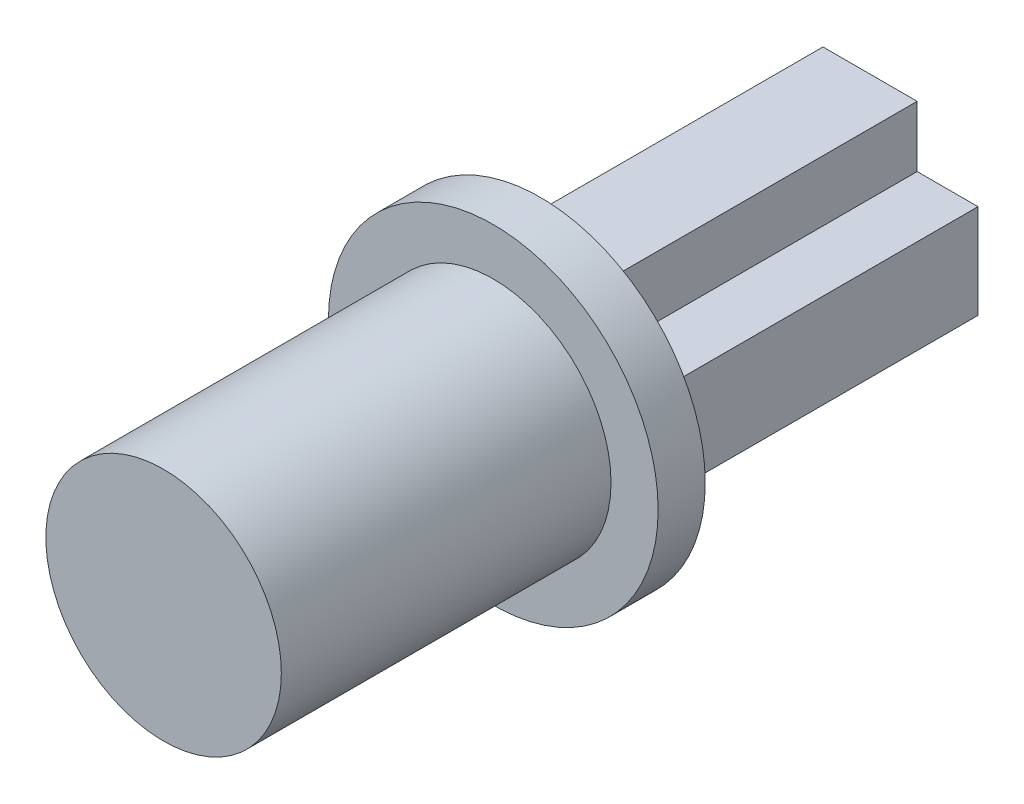
ISO-10303-21;
HEADER;
FILE_DESCRIPTION(('STEP AP214'),'2;1');
FILE_NAME('part.step','',(''),(''),'','','');
FILE_SCHEMA(('AUTOMOTIVE_DESIGN { 1 0 10303 214 1 1 1 1 }'));
ENDSEC;
DATA;
#1=APPLICATION_CONTEXT('core data for automotive mechanical design processes');
#2=APPLICATION_PROTOCOL_DEFINITION('international standard','automotive_design',2000,#1);
#3=PRODUCT_CONTEXT('',#1,'mechanical');
#4=PRODUCT('Part','Part','',(#3));
#5=PRODUCT_RELATED_PRODUCT_CATEGORY('part','',(#4));
#6=PRODUCT_DEFINITION_FORMATION('','',#4);
#7=PRODUCT_DEFINITION_CONTEXT('part definition',#1,'design');
#8=PRODUCT_DEFINITION('design','',#6,#7);
#9=PRODUCT_DEFINITION_SHAPE('','',#8);
#10=(LENGTH_UNIT() NAMED_UNIT(*) SI_UNIT(.MILLI.,.METRE.));
#11=(NAMED_UNIT(*) PLANE_ANGLE_UNIT() SI_UNIT($,.RADIAN.));
#12=(NAMED_UNIT(*) SI_UNIT($,.STERADIAN.) SOLID_ANGLE_UNIT());
#13=UNCERTAINTY_MEASURE_WITH_UNIT(LENGTH_MEASURE(1.E-05),#10,'distance_accuracy_value','');
#14=(GEOMETRIC_REPRESENTATION_CONTEXT(3) GLOBAL_UNCERTAINTY_ASSIGNED_CONTEXT((#13)) GLOBAL_UNIT_ASSIGNED_CONTEXT((#10,
#11,#12)) REPRESENTATION_CONTEXT('',''));
#15=CARTESIAN_POINT('',(0.,0.,0.));
#16=DIRECTION('',(0.,0.,1.));
#17=DIRECTION('',(1.,0.,0.));
#18=AXIS2_PLACEMENT_3D('',#15,#16,#17);
#19=CARTESIAN_POINT('',(2.29128784747792,0.973432182416137,7.));
#20=DIRECTION('',(-1.,0.,0.));
#21=DIRECTION('',(0.,-1.,0.));
#22=AXIS2_PLACEMENT_3D('',#19,#20,#21);
#23=PLANE('',#22);
#24=DIRECTION('',(0.,1.,0.));
#25=VECTOR('',#24,1.);
#26=CARTESIAN_POINT('',(2.29128784747792,0.973432182416137,0.));
#27=LINE('',#26,#25);
#28=CARTESIAN_POINT('',(2.29128784747791,-1.02656781758385,0.));
#29=VERTEX_POINT('',#28);
#30=CARTESIAN_POINT('',(2.29128784747792,0.973432182416137,0.));
#31=VERTEX_POINT('',#30);
#32=EDGE_CURVE('E185',#29,#31,#27,.T.);
#33=ORIENTED_EDGE('',*,*,#32,.T.);
#34=DIRECTION('',(0.,0.,-1.));
#35=VECTOR('',#34,1.);
#36=CARTESIAN_POINT('',(2.29128784747792,0.973432182416137,7.));
#37=LINE('',#36,#35);
#38=CARTESIAN_POINT('',(2.29128784747792,0.973432182416137,7.));
#39=VERTEX_POINT('',#38);
#40=EDGE_CURVE('E48',#39,#31,#37,.T.);
#41=ORIENTED_EDGE('',*,*,#40,.F.);
#42=DIRECTION('',(0.,1.,0.));
#43=VECTOR('',#42,1.);
#44=CARTESIAN_POINT('',(2.29128784747792,0.973432182416137,7.));
#45=LINE('',#44,#43);
#46=CARTESIAN_POINT('',(2.29128784747791,-1.02656781758385,7.));
#47=VERTEX_POINT('',#46);
#48=EDGE_CURVE('E220',#47,#39,#45,.T.);
#49=ORIENTED_EDGE('',*,*,#48,.F.);
#50=DIRECTION('',(0.,0.,-1.));
#51=VECTOR('',#50,1.);
#52=CARTESIAN_POINT('',(2.29128784747791,-1.02656781758385,7.));
#53=LINE('',#52,#51);
#54=EDGE_CURVE('E184',#47,#29,#53,.T.);
#55=ORIENTED_EDGE('',*,*,#54,.T.);
#56=EDGE_LOOP('',(#33,#41,#49,#55));
#57=FACE_BOUND('',#56,.T.);
#58=ADVANCED_FACE('F45',(#57),#23,.F.);
#59=CARTESIAN_POINT('',(0.999999999999991,0.973432182416137,7.));
#60=DIRECTION('',(0.,-1.,0.));
#61=DIRECTION('',(0.,0.,-1.));
#62=AXIS2_PLACEMENT_3D('',#59,#60,#61);
#63=PLANE('',#62);
#64=DIRECTION('',(-1.,0.,0.));
#65=VECTOR('',#64,1.);
#66=CARTESIAN_POINT('',(0.999999999999991,0.973432182416137,0.));
#67=LINE('',#66,#65);
#68=CARTESIAN_POINT('',(0.999999999999991,0.973432182416137,0.));
#69=VERTEX_POINT('',#68);
#70=EDGE_CURVE('E189',#31,#69,#67,.T.);
#71=ORIENTED_EDGE('',*,*,#70,.T.);
#72=DIRECTION('',(0.,0.,-1.));
#73=VECTOR('',#72,1.);
#74=CARTESIAN_POINT('',(0.999999999999991,0.973432182416137,7.));
#75=LINE('',#74,#73);
#76=CARTESIAN_POINT('',(0.999999999999991,0.973432182416137,7.));
#77=VERTEX_POINT('',#76);
#78=EDGE_CURVE('E248',#77,#69,#75,.T.);
#79=ORIENTED_EDGE('',*,*,#78,.F.);
#80=DIRECTION('',(-1.,0.,0.));
#81=VECTOR('',#80,1.);
#82=CARTESIAN_POINT('',(0.999999999999991,0.973432182416137,7.));
#83=LINE('',#82,#81);
#84=EDGE_CURVE('E118',#39,#77,#83,.T.);
#85=ORIENTED_EDGE('',*,*,#84,.F.);
#86=ORIENTED_EDGE('',*,*,#40,.T.);
#87=EDGE_LOOP('',(#71,#79,#85,#86));
#88=FACE_BOUND('',#87,.T.);
#89=ADVANCED_FACE('F255',(#88),#63,.F.);
#90=CARTESIAN_POINT('',(0.999999999999991,2.26472002989408,7.));
#91=DIRECTION('',(-1.,0.,0.));
#92=DIRECTION('',(0.,0.,1.));
#93=AXIS2_PLACEMENT_3D('',#90,#91,#92);
#94=PLANE('',#93);
#95=DIRECTION('',(0.,1.,0.));
#96=VECTOR('',#95,1.);
#97=CARTESIAN_POINT('',(0.999999999999991,2.26472002989408,0.));
#98=LINE('',#97,#96);
#99=CARTESIAN_POINT('',(0.999999999999991,2.26472002989408,0.));
#100=VERTEX_POINT('',#99);
#101=EDGE_CURVE('E193',#69,#100,#98,.T.);
#102=ORIENTED_EDGE('',*,*,#101,.T.);
#103=DIRECTION('',(0.,0.,-1.));
#104=VECTOR('',#103,1.);
#105=CARTESIAN_POINT('',(0.999999999999991,2.26472002989408,7.));
#106=LINE('',#105,#104);
#107=CARTESIAN_POINT('',(0.999999999999991,2.26472002989408,7.));
#108=VERTEX_POINT('',#107);
#109=EDGE_CURVE('E245',#108,#100,#106,.T.);
#110=ORIENTED_EDGE('',*,*,#109,.F.);
#111=DIRECTION('',(0.,1.,0.));
#112=VECTOR('',#111,1.);
#113=CARTESIAN_POINT('',(0.999999999999991,2.26472002989408,7.));
#114=LINE('',#113,#112);
#115=EDGE_CURVE('E275',#77,#108,#114,.T.);
#116=ORIENTED_EDGE('',*,*,#115,.F.);
#117=ORIENTED_EDGE('',*,*,#78,.T.);
#118=EDGE_LOOP('',(#102,#110,#116,#117));
#119=FACE_BOUND('',#118,.T.);
#120=ADVANCED_FACE('F264',(#119),#94,.F.);
#121=CARTESIAN_POINT('',(-0.999999999999997,2.26472002989408,7.));
#122=DIRECTION('',(0.,-1.,0.));
#123=DIRECTION('',(1.,0.,0.));
#124=AXIS2_PLACEMENT_3D('',#121,#122,#123);
#125=PLANE('',#124);
#126=DIRECTION('',(-1.,0.,0.));
#127=VECTOR('',#126,1.);
#128=CARTESIAN_POINT('',(-0.999999999999997,2.26472002989408,0.));
#129=LINE('',#128,#127);
#130=CARTESIAN_POINT('',(-0.999999999999997,2.26472002989408,0.));
#131=VERTEX_POINT('',#130);
#132=EDGE_CURVE('E196',#100,#131,#129,.T.);
#133=ORIENTED_EDGE('',*,*,#132,.T.);
#134=DIRECTION('',(0.,0.,-1.));
#135=VECTOR('',#134,1.);
#136=CARTESIAN_POINT('',(-0.999999999999997,2.26472002989408,7.));
#137=LINE('',#136,#135);
#138=CARTESIAN_POINT('',(-0.999999999999997,2.26472002989408,7.));
#139=VERTEX_POINT('',#138);
#140=EDGE_CURVE('E241',#139,#131,#137,.T.);
#141=ORIENTED_EDGE('',*,*,#140,.F.);
#142=DIRECTION('',(-1.,0.,0.));
#143=VECTOR('',#142,1.);
#144=CARTESIAN_POINT('',(-0.999999999999997,2.26472002989408,7.));
#145=LINE('',#144,#143);
#146=EDGE_CURVE('E269',#108,#139,#145,.T.);
#147=ORIENTED_EDGE('',*,*,#146,.F.);
#148=ORIENTED_EDGE('',*,*,#109,.T.);
#149=EDGE_LOOP('',(#133,#141,#147,#148));
#150=FACE_BOUND('',#149,.T.);
#151=ADVANCED_FACE('F267',(#150),#125,.F.);
#152=CARTESIAN_POINT('',(-0.999999999999997,0.97343218241615,7.));
#153=DIRECTION('',(1.,0.,0.));
#154=DIRECTION('',(0.,0.,-1.));
#155=AXIS2_PLACEMENT_3D('',#152,#153,#154);
#156=PLANE('',#155);
#157=DIRECTION('',(0.,-1.,0.));
#158=VECTOR('',#157,1.);
#159=CARTESIAN_POINT('',(-0.999999999999997,0.97343218241615,0.));
#160=LINE('',#159,#158);
#161=CARTESIAN_POINT('',(-0.999999999999997,0.97343218241615,0.));
#162=VERTEX_POINT('',#161);
#163=EDGE_CURVE('E199',#131,#162,#160,.T.);
#164=ORIENTED_EDGE('',*,*,#163,.T.);
#165=DIRECTION('',(0.,0.,-1.));
#166=VECTOR('',#165,1.);
#167=CARTESIAN_POINT('',(-0.999999999999997,0.97343218241615,7.));
#168=LINE('',#167,#166);
#169=CARTESIAN_POINT('',(-0.999999999999997,0.97343218241615,7.));
#170=VERTEX_POINT('',#169);
#171=EDGE_CURVE('E237',#170,#162,#168,.T.);
#172=ORIENTED_EDGE('',*,*,#171,.F.);
#173=DIRECTION('',(0.,-1.,0.));
#174=VECTOR('',#173,1.);
#175=CARTESIAN_POINT('',(-0.999999999999997,0.97343218241615,7.));
#176=LINE('',#175,#174);
#177=EDGE_CURVE('E274',#139,#170,#176,.T.);
#178=ORIENTED_EDGE('',*,*,#177,.F.);
#179=ORIENTED_EDGE('',*,*,#140,.T.);
#180=EDGE_LOOP('',(#164,#172,#178,#179));
#181=FACE_BOUND('',#180,.T.);
#182=ADVANCED_FACE('F319',(#181),#156,.F.);
#183=CARTESIAN_POINT('',(-2.29128784747793,0.97343218241615,7.));
#184=DIRECTION('',(0.,-1.,0.));
#185=DIRECTION('',(0.,0.,-1.));
#186=AXIS2_PLACEMENT_3D('',#183,#184,#185);
#187=PLANE('',#186);
#188=DIRECTION('',(-1.,0.,0.));
#189=VECTOR('',#188,1.);
#190=CARTESIAN_POINT('',(-2.29128784747793,0.97343218241615,0.));
#191=LINE('',#190,#189);
#192=CARTESIAN_POINT('',(-2.29128784747793,0.97343218241615,0.));
#193=VERTEX_POINT('',#192);
#194=EDGE_CURVE('E202',#162,#193,#191,.T.);
#195=ORIENTED_EDGE('',*,*,#194,.T.);
#196=DIRECTION('',(0.,0.,-1.));
#197=VECTOR('',#196,1.);
#198=CARTESIAN_POINT('',(-2.29128784747793,0.97343218241615,7.));
#199=LINE('',#198,#197);
#200=CARTESIAN_POINT('',(-2.29128784747793,0.97343218241615,7.));
#201=VERTEX_POINT('',#200);
#202=EDGE_CURVE('E233',#201,#193,#199,.T.);
#203=ORIENTED_EDGE('',*,*,#202,.F.);
#204=DIRECTION('',(-1.,0.,0.));
#205=VECTOR('',#204,1.);
#206=CARTESIAN_POINT('',(-2.29128784747793,0.97343218241615,7.));
#207=LINE('',#206,#205);
#208=EDGE_CURVE('E285',#170,#201,#207,.T.);
#209=ORIENTED_EDGE('',*,*,#208,.F.);
#210=ORIENTED_EDGE('',*,*,#171,.T.);
#211=EDGE_LOOP('',(#195,#203,#209,#210));
#212=FACE_BOUND('',#211,.T.);
#213=ADVANCED_FACE('F322',(#212),#187,.F.);
#214=CARTESIAN_POINT('',(-2.29128784747793,-1.02656781758384,7.));
#215=DIRECTION('',(1.,0.,0.));
#216=DIRECTION('',(0.,1.,0.));
#217=AXIS2_PLACEMENT_3D('',#214,#215,#216);
#218=PLANE('',#217);
#219=DIRECTION('',(0.,-1.,0.));
#220=VECTOR('',#219,1.);
#221=CARTESIAN_POINT('',(-2.29128784747793,-1.02656781758384,0.));
#222=LINE('',#221,#220);
#223=CARTESIAN_POINT('',(-2.29128784747793,-1.02656781758384,0.));
#224=VERTEX_POINT('',#223);
#225=EDGE_CURVE('E205',#193,#224,#222,.T.);
#226=ORIENTED_EDGE('',*,*,#225,.T.);
#227=DIRECTION('',(0.,0.,-1.));
#228=VECTOR('',#227,1.);
#229=CARTESIAN_POINT('',(-2.29128784747793,-1.02656781758384,7.));
#230=LINE('',#229,#228);
#231=CARTESIAN_POINT('',(-2.29128784747793,-1.02656781758384,7.));
#232=VERTEX_POINT('',#231);
#233=EDGE_CURVE('E229',#232,#224,#230,.T.);
#234=ORIENTED_EDGE('',*,*,#233,.F.);
#235=DIRECTION('',(0.,-1.,0.));
#236=VECTOR('',#235,1.);
#237=CARTESIAN_POINT('',(-2.29128784747793,-1.02656781758384,7.));
#238=LINE('',#237,#236);
#239=EDGE_CURVE('E175',#201,#232,#238,.T.);
#240=ORIENTED_EDGE('',*,*,#239,.F.);
#241=ORIENTED_EDGE('',*,*,#202,.T.);
#242=EDGE_LOOP('',(#226,#234,#240,#241));
#243=FACE_BOUND('',#242,.T.);
#244=ADVANCED_FACE('F292',(#243),#218,.F.);
#245=CARTESIAN_POINT('',(-0.999999999999997,-1.02656781758384,7.));
#246=DIRECTION('',(0.,1.,0.));
#247=DIRECTION('',(0.,0.,1.));
#248=AXIS2_PLACEMENT_3D('',#245,#246,#247);
#249=PLANE('',#248);
#250=DIRECTION('',(1.,0.,0.));
#251=VECTOR('',#250,1.);
#252=CARTESIAN_POINT('',(-0.999999999999997,-1.02656781758384,0.));
#253=LINE('',#252,#251);
#254=CARTESIAN_POINT('',(-0.999999999999997,-1.02656781758384,0.));
#255=VERTEX_POINT('',#254);
#256=EDGE_CURVE('E208',#224,#255,#253,.T.);
#257=ORIENTED_EDGE('',*,*,#256,.T.);
#258=DIRECTION('',(0.,0.,-1.));
#259=VECTOR('',#258,1.);
#260=CARTESIAN_POINT('',(-0.999999999999997,-1.02656781758384,7.));
#261=LINE('',#260,#259);
#262=CARTESIAN_POINT('',(-0.999999999999997,-1.02656781758384,7.));
#263=VERTEX_POINT('',#262);
#264=EDGE_CURVE('E156',#263,#255,#261,.T.);
#265=ORIENTED_EDGE('',*,*,#264,.F.);
#266=DIRECTION('',(1.,0.,0.));
#267=VECTOR('',#266,1.);
#268=CARTESIAN_POINT('',(-0.999999999999997,-1.02656781758384,7.));
#269=LINE('',#268,#267);
#270=EDGE_CURVE('E171',#232,#263,#269,.T.);
#271=ORIENTED_EDGE('',*,*,#270,.F.);
#272=ORIENTED_EDGE('',*,*,#233,.T.);
#273=EDGE_LOOP('',(#257,#265,#271,#272));
#274=FACE_BOUND('',#273,.T.);
#275=ADVANCED_FACE('F296',(#274),#249,.F.);
#276=CARTESIAN_POINT('',(-0.999999999999997,-2.31785566506177,7.));
#277=DIRECTION('',(1.,0.,0.));
#278=DIRECTION('',(0.,0.,-1.));
#279=AXIS2_PLACEMENT_3D('',#276,#277,#278);
#280=PLANE('',#279);
#281=DIRECTION('',(0.,-1.,0.));
#282=VECTOR('',#281,1.);
#283=CARTESIAN_POINT('',(-0.999999999999997,-2.31785566506177,0.));
#284=LINE('',#283,#282);
#285=CARTESIAN_POINT('',(-0.999999999999997,-2.31785566506177,0.));
#286=VERTEX_POINT('',#285);
#287=EDGE_CURVE('E152',#255,#286,#284,.T.);
#288=ORIENTED_EDGE('',*,*,#287,.T.);
#289=DIRECTION('',(0.,0.,-1.));
#290=VECTOR('',#289,1.);
#291=CARTESIAN_POINT('',(-0.999999999999997,-2.31785566506177,7.));
#292=LINE('',#291,#290);
#293=CARTESIAN_POINT('',(-0.999999999999997,-2.31785566506177,7.));
#294=VERTEX_POINT('',#293);
#295=EDGE_CURVE('E144',#294,#286,#292,.T.);
#296=ORIENTED_EDGE('',*,*,#295,.F.);
#297=DIRECTION('',(0.,-1.,0.));
#298=VECTOR('',#297,1.);
#299=CARTESIAN_POINT('',(-0.999999999999997,-2.31785566506177,7.));
#300=LINE('',#299,#298);
#301=EDGE_CURVE('E149',#263,#294,#300,.T.);
#302=ORIENTED_EDGE('',*,*,#301,.F.);
#303=ORIENTED_EDGE('',*,*,#264,.T.);
#304=EDGE_LOOP('',(#288,#296,#302,#303));
#305=FACE_BOUND('',#304,.T.);
#306=ADVANCED_FACE('F146',(#305),#280,.F.);
#307=CARTESIAN_POINT('',(0.999999999999991,-2.31785566506177,7.));
#308=DIRECTION('',(0.,1.,0.));
#309=DIRECTION('',(-1.,0.,0.));
#310=AXIS2_PLACEMENT_3D('',#307,#308,#309);
#311=PLANE('',#310);
#312=DIRECTION('',(1.,0.,0.));
#313=VECTOR('',#312,1.);
#314=CARTESIAN_POINT('',(0.999999999999991,-2.31785566506177,0.));
#315=LINE('',#314,#313);
#316=CARTESIAN_POINT('',(0.999999999999991,-2.31785566506177,0.));
#317=VERTEX_POINT('',#316);
#318=EDGE_CURVE('E213',#286,#317,#315,.T.);
#319=ORIENTED_EDGE('',*,*,#318,.T.);
#320=DIRECTION('',(0.,0.,-1.));
#321=VECTOR('',#320,1.);
#322=CARTESIAN_POINT('',(0.999999999999991,-2.31785566506177,7.));
#323=LINE('',#322,#321);
#324=CARTESIAN_POINT('',(0.999999999999991,-2.31785566506177,7.));
#325=VERTEX_POINT('',#324);
#326=EDGE_CURVE('E157',#325,#317,#323,.T.);
#327=ORIENTED_EDGE('',*,*,#326,.F.);
#328=DIRECTION('',(1.,0.,0.));
#329=VECTOR('',#328,1.);
#330=CARTESIAN_POINT('',(0.999999999999991,-2.31785566506177,7.));
#331=LINE('',#330,#329);
#332=EDGE_CURVE('E160',#294,#325,#331,.T.);
#333=ORIENTED_EDGE('',*,*,#332,.F.);
#334=ORIENTED_EDGE('',*,*,#295,.T.);
#335=EDGE_LOOP('',(#319,#327,#333,#334));
#336=FACE_BOUND('',#335,.T.);
#337=ADVANCED_FACE('F161',(#336),#311,.F.);
#338=CARTESIAN_POINT('',(0.999999999999991,-1.02656781758385,7.));
#339=DIRECTION('',(-1.,0.,0.));
#340=DIRECTION('',(0.,0.,1.));
#341=AXIS2_PLACEMENT_3D('',#338,#339,#340);
#342=PLANE('',#341);
#343=DIRECTION('',(0.,1.,0.));
#344=VECTOR('',#343,1.);
#345=CARTESIAN_POINT('',(0.999999999999991,-1.02656781758385,0.));
#346=LINE('',#345,#344);
#347=CARTESIAN_POINT('',(0.999999999999991,-1.02656781758385,0.));
#348=VERTEX_POINT('',#347);
#349=EDGE_CURVE('E103',#317,#348,#346,.T.);
#350=ORIENTED_EDGE('',*,*,#349,.T.);
#351=DIRECTION('',(0.,0.,-1.));
#352=VECTOR('',#351,1.);
#353=CARTESIAN_POINT('',(0.999999999999991,-1.02656781758385,7.));
#354=LINE('',#353,#352);
#355=CARTESIAN_POINT('',(0.999999999999991,-1.02656781758385,7.));
#356=VERTEX_POINT('',#355);
#357=EDGE_CURVE('E63',#356,#348,#354,.T.);
#358=ORIENTED_EDGE('',*,*,#357,.F.);
#359=DIRECTION('',(0.,1.,0.));
#360=VECTOR('',#359,1.);
#361=CARTESIAN_POINT('',(0.999999999999991,-1.02656781758385,7.));
#362=LINE('',#361,#360);
#363=EDGE_CURVE('E165',#325,#356,#362,.T.);
#364=ORIENTED_EDGE('',*,*,#363,.F.);
#365=ORIENTED_EDGE('',*,*,#326,.T.);
#366=EDGE_LOOP('',(#350,#358,#364,#365));
#367=FACE_BOUND('',#366,.T.);
#368=ADVANCED_FACE('F297',(#367),#342,.F.);
#369=CARTESIAN_POINT('',(2.29128784747791,-1.02656781758385,7.));
#370=DIRECTION('',(0.,1.,0.));
#371=DIRECTION('',(0.,0.,1.));
#372=AXIS2_PLACEMENT_3D('',#369,#370,#371);
#373=PLANE('',#372);
#374=DIRECTION('',(1.,0.,0.));
#375=VECTOR('',#374,1.);
#376=CARTESIAN_POINT('',(2.29128784747791,-1.02656781758385,0.));
#377=LINE('',#376,#375);
#378=EDGE_CURVE('E109',#348,#29,#377,.T.);
#379=ORIENTED_EDGE('',*,*,#378,.T.);
#380=ORIENTED_EDGE('',*,*,#54,.F.);
#381=DIRECTION('',(1.,0.,0.));
#382=VECTOR('',#381,1.);
#383=CARTESIAN_POINT('',(2.29128784747791,-1.02656781758385,7.));
#384=LINE('',#383,#382);
#385=EDGE_CURVE('E181',#356,#47,#384,.T.);
#386=ORIENTED_EDGE('',*,*,#385,.F.);
#387=ORIENTED_EDGE('',*,*,#357,.T.);
#388=EDGE_LOOP('',(#379,#380,#386,#387));
#389=FACE_BOUND('',#388,.T.);
#390=ADVANCED_FACE('F298',(#389),#373,.F.);
#391=CARTESIAN_POINT('',(0.,0.,0.));
#392=DIRECTION('',(0.,0.,-1.));
#393=DIRECTION('',(-1.,0.,0.));
#394=AXIS2_PLACEMENT_3D('',#391,#392,#393);
#395=PLANE('',#394);
#396=ORIENTED_EDGE('',*,*,#32,.F.);
#397=ORIENTED_EDGE('',*,*,#378,.F.);
#398=ORIENTED_EDGE('',*,*,#349,.F.);
#399=ORIENTED_EDGE('',*,*,#318,.F.);
#400=ORIENTED_EDGE('',*,*,#287,.F.);
#401=ORIENTED_EDGE('',*,*,#256,.F.);
#402=ORIENTED_EDGE('',*,*,#225,.F.);
#403=ORIENTED_EDGE('',*,*,#194,.F.);
#404=ORIENTED_EDGE('',*,*,#163,.F.);
#405=ORIENTED_EDGE('',*,*,#132,.F.);
#406=ORIENTED_EDGE('',*,*,#101,.F.);
#407=ORIENTED_EDGE('',*,*,#70,.F.);
#408=EDGE_LOOP('',(#396,#397,#398,#399,#400,#401,#402,#403,#404,#405,#406,#407));
#409=FACE_BOUND('',#408,.T.);
#410=ADVANCED_FACE('F261',(#409),#395,.T.);
#411=CARTESIAN_POINT('',(0.,0.,7.));
#412=DIRECTION('',(0.,0.,1.));
#413=DIRECTION('',(1.,0.,0.));
#414=AXIS2_PLACEMENT_3D('',#411,#412,#413);
#415=PLANE('',#414);
#416=CARTESIAN_POINT('',(0.,0.,7.));
#417=DIRECTION('',(0.,0.,1.));
#418=DIRECTION('',(1.,0.,0.));
#419=AXIS2_PLACEMENT_3D('',#416,#417,#418);
#420=CIRCLE('',#419,3.5);
#421=CARTESIAN_POINT('',(3.5,0.,7.));
#422=VERTEX_POINT('',#421);
#423=EDGE_CURVE('E409',#422,#422,#420,.T.);
#424=ORIENTED_EDGE('',*,*,#423,.F.);
#425=EDGE_LOOP('',(#424));
#426=FACE_BOUND('',#425,.T.);
#427=ORIENTED_EDGE('',*,*,#385,.T.);
#428=ORIENTED_EDGE('',*,*,#48,.T.);
#429=ORIENTED_EDGE('',*,*,#84,.T.);
#430=ORIENTED_EDGE('',*,*,#115,.T.);
#431=ORIENTED_EDGE('',*,*,#146,.T.);
#432=ORIENTED_EDGE('',*,*,#177,.T.);
#433=ORIENTED_EDGE('',*,*,#208,.T.);
#434=ORIENTED_EDGE('',*,*,#239,.T.);
#435=ORIENTED_EDGE('',*,*,#270,.T.);
#436=ORIENTED_EDGE('',*,*,#301,.T.);
#437=ORIENTED_EDGE('',*,*,#332,.T.);
#438=ORIENTED_EDGE('',*,*,#363,.T.);
#439=EDGE_LOOP('',(#427,#428,#429,#430,#431,#432,#433,#434,#435,#436,#437,#438));
#440=FACE_BOUND('',#439,.T.);
#441=ADVANCED_FACE('F168',(#426,#440),#415,.F.);
#442=CARTESIAN_POINT('',(0.,0.,8.));
#443=DIRECTION('',(0.,0.,-1.));
#444=DIRECTION('',(-1.,0.,0.));
#445=AXIS2_PLACEMENT_3D('',#442,#443,#444);
#446=CYLINDRICAL_SURFACE('',#445,3.5);
#447=CARTESIAN_POINT('',(0.,0.,8.));
#448=DIRECTION('',(0.,0.,1.));
#449=DIRECTION('',(1.,0.,0.));
#450=AXIS2_PLACEMENT_3D('',#447,#448,#449);
#451=CIRCLE('',#450,3.5);
#452=CARTESIAN_POINT('',(3.5,0.,8.));
#453=VERTEX_POINT('',#452);
#454=EDGE_CURVE('E190',#453,#453,#451,.T.);
#455=ORIENTED_EDGE('',*,*,#454,.F.);
#456=EDGE_LOOP('',(#455));
#457=FACE_BOUND('',#456,.T.);
#458=ORIENTED_EDGE('',*,*,#423,.T.);
#459=EDGE_LOOP('',(#458));
#460=FACE_BOUND('',#459,.T.);
#461=ADVANCED_FACE('F362',(#457,#460),#446,.T.);
#462=CARTESIAN_POINT('',(0.,0.,8.));
#463=DIRECTION('',(0.,0.,1.));
#464=DIRECTION('',(1.,0.,0.));
#465=AXIS2_PLACEMENT_3D('',#462,#463,#464);
#466=PLANE('',#465);
#467=CARTESIAN_POINT('',(0.,0.,8.));
#468=DIRECTION('',(0.,0.,1.));
#469=DIRECTION('',(1.,0.,0.));
#470=AXIS2_PLACEMENT_3D('',#467,#468,#469);
#471=CIRCLE('',#470,2.5);
#472=CARTESIAN_POINT('',(2.5,0.,8.));
#473=VERTEX_POINT('',#472);
#474=EDGE_CURVE('E11',#473,#473,#471,.T.);
#475=ORIENTED_EDGE('',*,*,#474,.F.);
#476=EDGE_LOOP('',(#475));
#477=FACE_BOUND('',#476,.T.);
#478=ORIENTED_EDGE('',*,*,#454,.T.);
#479=EDGE_LOOP('',(#478));
#480=FACE_BOUND('',#479,.T.);
#481=ADVANCED_FACE('F372',(#477,#480),#466,.T.);
#482=CARTESIAN_POINT('',(0.,0.,15.));
#483=DIRECTION('',(0.,0.,-1.));
#484=DIRECTION('',(-1.,0.,0.));
#485=AXIS2_PLACEMENT_3D('',#482,#483,#484);
#486=CYLINDRICAL_SURFACE('',#485,2.5);
#487=CARTESIAN_POINT('',(0.,0.,15.));
#488=DIRECTION('',(0.,0.,1.));
#489=DIRECTION('',(1.,0.,0.));
#490=AXIS2_PLACEMENT_3D('',#487,#488,#489);
#491=CIRCLE('',#490,2.5);
#492=CARTESIAN_POINT('',(2.5,0.,15.));
#493=VERTEX_POINT('',#492);
#494=EDGE_CURVE('E407',#493,#493,#491,.T.);
#495=ORIENTED_EDGE('',*,*,#494,.F.);
#496=EDGE_LOOP('',(#495));
#497=FACE_BOUND('',#496,.T.);
#498=ORIENTED_EDGE('',*,*,#474,.T.);
#499=EDGE_LOOP('',(#498));
#500=FACE_BOUND('',#499,.T.);
#501=ADVANCED_FACE('F382',(#497,#500),#486,.T.);
#502=CARTESIAN_POINT('',(0.,0.,15.));
#503=DIRECTION('',(0.,0.,1.));
#504=DIRECTION('',(1.,0.,0.));
#505=AXIS2_PLACEMENT_3D('',#502,#503,#504);
#506=PLANE('',#505);
#507=ORIENTED_EDGE('',*,*,#494,.T.);
#508=EDGE_LOOP('',(#507));
#509=FACE_BOUND('',#508,.T.);
#510=ADVANCED_FACE('F392',(#509),#506,.T.);
#511=CLOSED_SHELL('',(#58,#89,#120,#151,#182,#213,#244,#275,#306,#337,#368,#390,#410,#441,#461,
#481,#501,#510));
#512=MANIFOLD_SOLID_BREP('B2',#511);
#513=ADVANCED_BREP_SHAPE_REPRESENTATION('',(#18,#512),#14);
#514=SHAPE_DEFINITION_REPRESENTATION(#9,#513);
ENDSEC;
END-ISO-10303-21;
